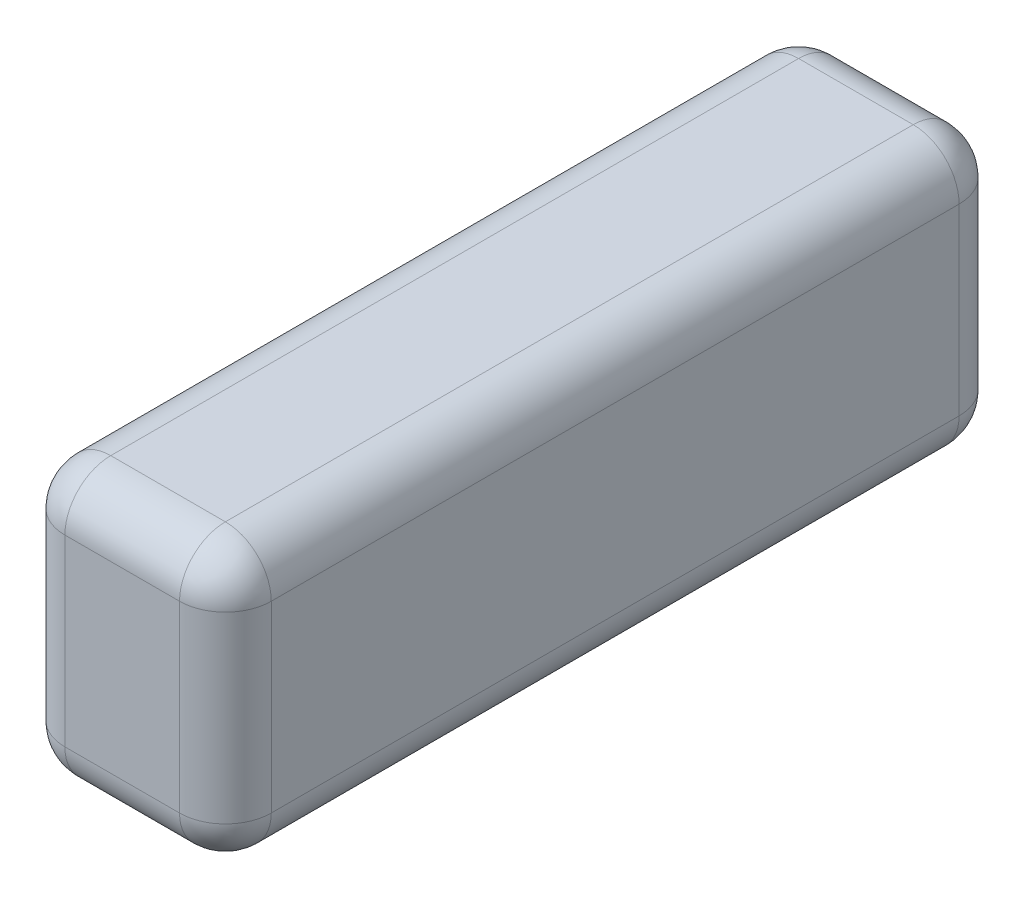
ISO-10303-21;
HEADER;
FILE_DESCRIPTION(('STEP AP214'),'2;1');
FILE_NAME('part.step','',(''),(''),'','','');
FILE_SCHEMA(('AUTOMOTIVE_DESIGN { 1 0 10303 214 1 1 1 1 }'));
ENDSEC;
DATA;
#1=APPLICATION_CONTEXT('core data for automotive mechanical design processes');
#2=APPLICATION_PROTOCOL_DEFINITION('international standard','automotive_design',2000,#1);
#3=PRODUCT_CONTEXT('',#1,'mechanical');
#4=PRODUCT('Part','Part','',(#3));
#5=PRODUCT_RELATED_PRODUCT_CATEGORY('part','',(#4));
#6=PRODUCT_DEFINITION_FORMATION('','',#4);
#7=PRODUCT_DEFINITION_CONTEXT('part definition',#1,'design');
#8=PRODUCT_DEFINITION('design','',#6,#7);
#9=PRODUCT_DEFINITION_SHAPE('','',#8);
#10=(LENGTH_UNIT() NAMED_UNIT(*) SI_UNIT(.MILLI.,.METRE.));
#11=(NAMED_UNIT(*) PLANE_ANGLE_UNIT() SI_UNIT($,.RADIAN.));
#12=(NAMED_UNIT(*) SI_UNIT($,.STERADIAN.) SOLID_ANGLE_UNIT());
#13=UNCERTAINTY_MEASURE_WITH_UNIT(LENGTH_MEASURE(1.E-05),#10,'distance_accuracy_value','');
#14=(GEOMETRIC_REPRESENTATION_CONTEXT(3) GLOBAL_UNCERTAINTY_ASSIGNED_CONTEXT((#13)) GLOBAL_UNIT_ASSIGNED_CONTEXT((#10,
#11,#12)) REPRESENTATION_CONTEXT('',''));
#15=CARTESIAN_POINT('',(0.,0.,0.));
#16=DIRECTION('',(0.,0.,1.));
#17=DIRECTION('',(1.,0.,0.));
#18=AXIS2_PLACEMENT_3D('',#15,#16,#17);
#19=CARTESIAN_POINT('',(0.,0.,170.));
#20=DIRECTION('',(1.,0.,0.));
#21=DIRECTION('',(0.,0.,-1.));
#22=AXIS2_PLACEMENT_3D('',#19,#20,#21);
#23=PLANE('',#22);
#24=DIRECTION('',(0.,-1.,0.));
#25=VECTOR('',#24,1.);
#26=CARTESIAN_POINT('',(0.,0.,160.));
#27=LINE('',#26,#25);
#28=CARTESIAN_POINT('',(0.,10.,160.));
#29=VERTEX_POINT('',#28);
#30=CARTESIAN_POINT('',(0.,50.,160.));
#31=VERTEX_POINT('',#30);
#32=EDGE_CURVE('E173',#29,#31,#27,.F.);
#33=ORIENTED_EDGE('',*,*,#32,.T.);
#34=DIRECTION('',(0.,0.,-1.));
#35=VECTOR('',#34,1.);
#36=CARTESIAN_POINT('',(0.,50.,170.));
#37=LINE('',#36,#35);
#38=CARTESIAN_POINT('',(0.,50.,10.));
#39=VERTEX_POINT('',#38);
#40=EDGE_CURVE('E140',#31,#39,#37,.T.);
#41=ORIENTED_EDGE('',*,*,#40,.T.);
#42=DIRECTION('',(0.,-1.,0.));
#43=VECTOR('',#42,1.);
#44=CARTESIAN_POINT('',(0.,0.,10.));
#45=LINE('',#44,#43);
#46=CARTESIAN_POINT('',(0.,10.,10.));
#47=VERTEX_POINT('',#46);
#48=EDGE_CURVE('E177',#39,#47,#45,.T.);
#49=ORIENTED_EDGE('',*,*,#48,.T.);
#50=DIRECTION('',(0.,0.,-1.));
#51=VECTOR('',#50,1.);
#52=CARTESIAN_POINT('',(0.,10.,170.));
#53=LINE('',#52,#51);
#54=EDGE_CURVE('E175',#47,#29,#53,.F.);
#55=ORIENTED_EDGE('',*,*,#54,.T.);
#56=EDGE_LOOP('',(#33,#41,#49,#55));
#57=FACE_BOUND('',#56,.T.);
#58=ADVANCED_FACE('F32',(#57),#23,.F.);
#59=CARTESIAN_POINT('',(0.,0.,170.));
#60=DIRECTION('',(0.,1.,0.));
#61=DIRECTION('',(0.,0.,1.));
#62=AXIS2_PLACEMENT_3D('',#59,#60,#61);
#63=PLANE('',#62);
#64=DIRECTION('',(0.,0.,-1.));
#65=VECTOR('',#64,1.);
#66=CARTESIAN_POINT('',(10.,0.,170.));
#67=LINE('',#66,#65);
#68=CARTESIAN_POINT('',(10.,0.,160.));
#69=VERTEX_POINT('',#68);
#70=CARTESIAN_POINT('',(10.,0.,10.));
#71=VERTEX_POINT('',#70);
#72=EDGE_CURVE('E193',#69,#71,#67,.T.);
#73=ORIENTED_EDGE('',*,*,#72,.T.);
#74=DIRECTION('',(1.,0.,0.));
#75=VECTOR('',#74,1.);
#76=CARTESIAN_POINT('',(45.,0.,10.));
#77=LINE('',#76,#75);
#78=CARTESIAN_POINT('',(35.,0.,10.));
#79=VERTEX_POINT('',#78);
#80=EDGE_CURVE('E196',#71,#79,#77,.T.);
#81=ORIENTED_EDGE('',*,*,#80,.T.);
#82=DIRECTION('',(0.,0.,-1.));
#83=VECTOR('',#82,1.);
#84=CARTESIAN_POINT('',(35.,0.,170.));
#85=LINE('',#84,#83);
#86=CARTESIAN_POINT('',(35.,0.,160.));
#87=VERTEX_POINT('',#86);
#88=EDGE_CURVE('E191',#79,#87,#85,.F.);
#89=ORIENTED_EDGE('',*,*,#88,.T.);
#90=DIRECTION('',(1.,0.,0.));
#91=VECTOR('',#90,1.);
#92=CARTESIAN_POINT('',(0.,0.,160.));
#93=LINE('',#92,#91);
#94=EDGE_CURVE('E189',#87,#69,#93,.F.);
#95=ORIENTED_EDGE('',*,*,#94,.T.);
#96=EDGE_LOOP('',(#73,#81,#89,#95));
#97=FACE_BOUND('',#96,.T.);
#98=ADVANCED_FACE('F274',(#97),#63,.F.);
#99=CARTESIAN_POINT('',(45.,0.,170.));
#100=DIRECTION('',(-1.,0.,0.));
#101=DIRECTION('',(0.,0.,1.));
#102=AXIS2_PLACEMENT_3D('',#99,#100,#101);
#103=PLANE('',#102);
#104=DIRECTION('',(0.,1.,0.));
#105=VECTOR('',#104,1.);
#106=CARTESIAN_POINT('',(45.,60.,10.));
#107=LINE('',#106,#105);
#108=CARTESIAN_POINT('',(45.,10.,10.));
#109=VERTEX_POINT('',#108);
#110=CARTESIAN_POINT('',(45.,50.,10.));
#111=VERTEX_POINT('',#110);
#112=EDGE_CURVE('E168',#109,#111,#107,.T.);
#113=ORIENTED_EDGE('',*,*,#112,.T.);
#114=DIRECTION('',(0.,0.,-1.));
#115=VECTOR('',#114,1.);
#116=CARTESIAN_POINT('',(45.,50.,170.));
#117=LINE('',#116,#115);
#118=CARTESIAN_POINT('',(45.,50.,160.));
#119=VERTEX_POINT('',#118);
#120=EDGE_CURVE('E170',#111,#119,#117,.F.);
#121=ORIENTED_EDGE('',*,*,#120,.T.);
#122=DIRECTION('',(0.,1.,0.));
#123=VECTOR('',#122,1.);
#124=CARTESIAN_POINT('',(45.,0.,160.));
#125=LINE('',#124,#123);
#126=CARTESIAN_POINT('',(45.,10.,160.));
#127=VERTEX_POINT('',#126);
#128=EDGE_CURVE('E164',#119,#127,#125,.F.);
#129=ORIENTED_EDGE('',*,*,#128,.T.);
#130=DIRECTION('',(0.,0.,-1.));
#131=VECTOR('',#130,1.);
#132=CARTESIAN_POINT('',(45.,10.,170.));
#133=LINE('',#132,#131);
#134=EDGE_CURVE('E166',#127,#109,#133,.T.);
#135=ORIENTED_EDGE('',*,*,#134,.T.);
#136=EDGE_LOOP('',(#113,#121,#129,#135));
#137=FACE_BOUND('',#136,.T.);
#138=ADVANCED_FACE('F301',(#137),#103,.F.);
#139=CARTESIAN_POINT('',(0.,60.,170.));
#140=DIRECTION('',(0.,-1.,0.));
#141=DIRECTION('',(0.,0.,-1.));
#142=AXIS2_PLACEMENT_3D('',#139,#140,#141);
#143=PLANE('',#142);
#144=DIRECTION('',(0.,0.,-1.));
#145=VECTOR('',#144,1.);
#146=CARTESIAN_POINT('',(35.,60.,170.));
#147=LINE('',#146,#145);
#148=CARTESIAN_POINT('',(35.,60.,160.));
#149=VERTEX_POINT('',#148);
#150=CARTESIAN_POINT('',(35.,60.,10.));
#151=VERTEX_POINT('',#150);
#152=EDGE_CURVE('E132',#149,#151,#147,.T.);
#153=ORIENTED_EDGE('',*,*,#152,.T.);
#154=DIRECTION('',(-1.,0.,0.));
#155=VECTOR('',#154,1.);
#156=CARTESIAN_POINT('',(0.,60.,10.));
#157=LINE('',#156,#155);
#158=CARTESIAN_POINT('',(10.,60.,10.));
#159=VERTEX_POINT('',#158);
#160=EDGE_CURVE('E128',#151,#159,#157,.T.);
#161=ORIENTED_EDGE('',*,*,#160,.T.);
#162=DIRECTION('',(0.,0.,-1.));
#163=VECTOR('',#162,1.);
#164=CARTESIAN_POINT('',(10.,60.,170.));
#165=LINE('',#164,#163);
#166=CARTESIAN_POINT('',(10.,60.,160.));
#167=VERTEX_POINT('',#166);
#168=EDGE_CURVE('E120',#159,#167,#165,.F.);
#169=ORIENTED_EDGE('',*,*,#168,.T.);
#170=DIRECTION('',(-1.,0.,0.));
#171=VECTOR('',#170,1.);
#172=CARTESIAN_POINT('',(0.,60.,160.));
#173=LINE('',#172,#171);
#174=EDGE_CURVE('E125',#167,#149,#173,.F.);
#175=ORIENTED_EDGE('',*,*,#174,.T.);
#176=EDGE_LOOP('',(#153,#161,#169,#175));
#177=FACE_BOUND('',#176,.T.);
#178=ADVANCED_FACE('F123',(#177),#143,.F.);
#179=CARTESIAN_POINT('',(0.,0.,170.));
#180=DIRECTION('',(0.,0.,-1.));
#181=DIRECTION('',(-1.,0.,0.));
#182=AXIS2_PLACEMENT_3D('',#179,#180,#181);
#183=PLANE('',#182);
#184=DIRECTION('',(0.,1.,0.));
#185=VECTOR('',#184,1.);
#186=CARTESIAN_POINT('',(35.,0.,170.));
#187=LINE('',#186,#185);
#188=CARTESIAN_POINT('',(35.,10.,170.));
#189=VERTEX_POINT('',#188);
#190=CARTESIAN_POINT('',(35.,50.,170.));
#191=VERTEX_POINT('',#190);
#192=EDGE_CURVE('E41',#189,#191,#187,.T.);
#193=ORIENTED_EDGE('',*,*,#192,.T.);
#194=DIRECTION('',(-1.,0.,0.));
#195=VECTOR('',#194,1.);
#196=CARTESIAN_POINT('',(0.,50.,170.));
#197=LINE('',#196,#195);
#198=CARTESIAN_POINT('',(10.,50.,170.));
#199=VERTEX_POINT('',#198);
#200=EDGE_CURVE('E11',#191,#199,#197,.T.);
#201=ORIENTED_EDGE('',*,*,#200,.T.);
#202=DIRECTION('',(0.,-1.,0.));
#203=VECTOR('',#202,1.);
#204=CARTESIAN_POINT('',(10.,0.,170.));
#205=LINE('',#204,#203);
#206=CARTESIAN_POINT('',(10.,10.,170.));
#207=VERTEX_POINT('',#206);
#208=EDGE_CURVE('E198',#199,#207,#205,.T.);
#209=ORIENTED_EDGE('',*,*,#208,.T.);
#210=DIRECTION('',(1.,0.,0.));
#211=VECTOR('',#210,1.);
#212=CARTESIAN_POINT('',(0.,10.,170.));
#213=LINE('',#212,#211);
#214=EDGE_CURVE('E52',#207,#189,#213,.T.);
#215=ORIENTED_EDGE('',*,*,#214,.T.);
#216=EDGE_LOOP('',(#193,#201,#209,#215));
#217=FACE_BOUND('',#216,.T.);
#218=ADVANCED_FACE('F363',(#217),#183,.F.);
#219=CARTESIAN_POINT('',(0.,0.,0.));
#220=DIRECTION('',(0.,0.,-1.));
#221=DIRECTION('',(-1.,0.,0.));
#222=AXIS2_PLACEMENT_3D('',#219,#220,#221);
#223=PLANE('',#222);
#224=DIRECTION('',(-1.,0.,0.));
#225=VECTOR('',#224,1.);
#226=CARTESIAN_POINT('',(45.,50.,0.));
#227=LINE('',#226,#225);
#228=CARTESIAN_POINT('',(10.,50.,0.));
#229=VERTEX_POINT('',#228);
#230=CARTESIAN_POINT('',(35.,50.,0.));
#231=VERTEX_POINT('',#230);
#232=EDGE_CURVE('E184',#229,#231,#227,.F.);
#233=ORIENTED_EDGE('',*,*,#232,.T.);
#234=DIRECTION('',(0.,1.,0.));
#235=VECTOR('',#234,1.);
#236=CARTESIAN_POINT('',(35.,0.,0.));
#237=LINE('',#236,#235);
#238=CARTESIAN_POINT('',(35.,10.,0.));
#239=VERTEX_POINT('',#238);
#240=EDGE_CURVE('E186',#231,#239,#237,.F.);
#241=ORIENTED_EDGE('',*,*,#240,.T.);
#242=DIRECTION('',(1.,0.,0.));
#243=VECTOR('',#242,1.);
#244=CARTESIAN_POINT('',(0.,10.,0.));
#245=LINE('',#244,#243);
#246=CARTESIAN_POINT('',(10.,10.,0.));
#247=VERTEX_POINT('',#246);
#248=EDGE_CURVE('E180',#239,#247,#245,.F.);
#249=ORIENTED_EDGE('',*,*,#248,.T.);
#250=DIRECTION('',(0.,-1.,0.));
#251=VECTOR('',#250,1.);
#252=CARTESIAN_POINT('',(10.,60.,0.));
#253=LINE('',#252,#251);
#254=EDGE_CURVE('E182',#247,#229,#253,.F.);
#255=ORIENTED_EDGE('',*,*,#254,.T.);
#256=EDGE_LOOP('',(#233,#241,#249,#255));
#257=FACE_BOUND('',#256,.T.);
#258=ADVANCED_FACE('F265',(#257),#223,.T.);
#259=CARTESIAN_POINT('',(10.,10.,170.));
#260=DIRECTION('',(0.,0.,-1.));
#261=DIRECTION('',(-1.,0.,0.));
#262=AXIS2_PLACEMENT_3D('',#259,#260,#261);
#263=CYLINDRICAL_SURFACE('',#262,10.);
#264=CARTESIAN_POINT('',(10.,10.,160.));
#265=DIRECTION('',(0.,0.,1.));
#266=DIRECTION('',(1.,0.,0.));
#267=AXIS2_PLACEMENT_3D('',#264,#265,#266);
#268=CIRCLE('',#267,10.);
#269=EDGE_CURVE('E36',#29,#69,#268,.T.);
#270=ORIENTED_EDGE('',*,*,#269,.F.);
#271=ORIENTED_EDGE('',*,*,#54,.F.);
#272=CARTESIAN_POINT('',(10.,10.,10.));
#273=DIRECTION('',(0.,0.,-1.));
#274=DIRECTION('',(-1.,0.,0.));
#275=AXIS2_PLACEMENT_3D('',#272,#273,#274);
#276=CIRCLE('',#275,10.);
#277=EDGE_CURVE('E160',#71,#47,#276,.T.);
#278=ORIENTED_EDGE('',*,*,#277,.F.);
#279=ORIENTED_EDGE('',*,*,#72,.F.);
#280=EDGE_LOOP('',(#270,#271,#278,#279));
#281=FACE_BOUND('',#280,.T.);
#282=ADVANCED_FACE('F34',(#281),#263,.T.);
#283=CARTESIAN_POINT('',(10.,10.,160.));
#284=DIRECTION('',(0.,0.,1.));
#285=DIRECTION('',(1.,0.,0.));
#286=AXIS2_PLACEMENT_3D('',#283,#284,#285);
#287=SPHERICAL_SURFACE('',#286,10.);
#288=CARTESIAN_POINT('',(10.,10.,160.));
#289=DIRECTION('',(0.,-1.,0.));
#290=DIRECTION('',(0.,0.,-1.));
#291=AXIS2_PLACEMENT_3D('',#288,#289,#290);
#292=CIRCLE('',#291,10.);
#293=EDGE_CURVE('E244',#29,#207,#292,.F.);
#294=ORIENTED_EDGE('',*,*,#293,.F.);
#295=ORIENTED_EDGE('',*,*,#269,.T.);
#296=CARTESIAN_POINT('',(10.,10.,160.));
#297=DIRECTION('',(-1.,0.,0.));
#298=DIRECTION('',(0.,0.,1.));
#299=AXIS2_PLACEMENT_3D('',#296,#297,#298);
#300=CIRCLE('',#299,10.);
#301=EDGE_CURVE('E247',#207,#69,#300,.F.);
#302=ORIENTED_EDGE('',*,*,#301,.F.);
#303=EDGE_LOOP('',(#294,#295,#302));
#304=FACE_BOUND('',#303,.T.);
#305=ADVANCED_FACE('F291',(#304),#287,.T.);
#306=CARTESIAN_POINT('',(10.,10.,10.));
#307=DIRECTION('',(0.,0.,1.));
#308=DIRECTION('',(1.,0.,0.));
#309=AXIS2_PLACEMENT_3D('',#306,#307,#308);
#310=SPHERICAL_SURFACE('',#309,10.);
#311=CARTESIAN_POINT('',(10.,10.,10.));
#312=DIRECTION('',(-1.,0.,0.));
#313=DIRECTION('',(0.,0.,1.));
#314=AXIS2_PLACEMENT_3D('',#311,#312,#313);
#315=CIRCLE('',#314,10.);
#316=EDGE_CURVE('E238',#71,#247,#315,.F.);
#317=ORIENTED_EDGE('',*,*,#316,.F.);
#318=ORIENTED_EDGE('',*,*,#277,.T.);
#319=CARTESIAN_POINT('',(10.,10.,10.));
#320=DIRECTION('',(0.,-1.,0.));
#321=DIRECTION('',(0.,0.,-1.));
#322=AXIS2_PLACEMENT_3D('',#319,#320,#321);
#323=CIRCLE('',#322,10.);
#324=EDGE_CURVE('E241',#247,#47,#323,.F.);
#325=ORIENTED_EDGE('',*,*,#324,.F.);
#326=EDGE_LOOP('',(#317,#318,#325));
#327=FACE_BOUND('',#326,.T.);
#328=ADVANCED_FACE('F254',(#327),#310,.T.);
#329=CARTESIAN_POINT('',(0.,10.,160.));
#330=DIRECTION('',(1.,0.,0.));
#331=DIRECTION('',(0.,0.,-1.));
#332=AXIS2_PLACEMENT_3D('',#329,#330,#331);
#333=CYLINDRICAL_SURFACE('',#332,10.);
#334=ORIENTED_EDGE('',*,*,#301,.T.);
#335=ORIENTED_EDGE('',*,*,#94,.F.);
#336=CARTESIAN_POINT('',(35.,10.,160.));
#337=DIRECTION('',(1.,0.,0.));
#338=DIRECTION('',(0.,0.,-1.));
#339=AXIS2_PLACEMENT_3D('',#336,#337,#338);
#340=CIRCLE('',#339,10.);
#341=EDGE_CURVE('E232',#189,#87,#340,.T.);
#342=ORIENTED_EDGE('',*,*,#341,.F.);
#343=ORIENTED_EDGE('',*,*,#214,.F.);
#344=EDGE_LOOP('',(#334,#335,#342,#343));
#345=FACE_BOUND('',#344,.T.);
#346=ADVANCED_FACE('F286',(#345),#333,.T.);
#347=CARTESIAN_POINT('',(10.,0.,160.));
#348=DIRECTION('',(0.,-1.,0.));
#349=DIRECTION('',(0.,0.,-1.));
#350=AXIS2_PLACEMENT_3D('',#347,#348,#349);
#351=CYLINDRICAL_SURFACE('',#350,10.);
#352=ORIENTED_EDGE('',*,*,#293,.T.);
#353=ORIENTED_EDGE('',*,*,#208,.F.);
#354=CARTESIAN_POINT('',(10.,50.,160.));
#355=DIRECTION('',(0.,1.,0.));
#356=DIRECTION('',(0.,0.,1.));
#357=AXIS2_PLACEMENT_3D('',#354,#355,#356);
#358=CIRCLE('',#357,10.);
#359=EDGE_CURVE('E144',#31,#199,#358,.T.);
#360=ORIENTED_EDGE('',*,*,#359,.F.);
#361=ORIENTED_EDGE('',*,*,#32,.F.);
#362=EDGE_LOOP('',(#352,#353,#360,#361));
#363=FACE_BOUND('',#362,.T.);
#364=ADVANCED_FACE('F294',(#363),#351,.T.);
#365=CARTESIAN_POINT('',(10.,50.,170.));
#366=DIRECTION('',(0.,0.,-1.));
#367=DIRECTION('',(-1.,0.,0.));
#368=AXIS2_PLACEMENT_3D('',#365,#366,#367);
#369=CYLINDRICAL_SURFACE('',#368,10.);
#370=CARTESIAN_POINT('',(10.,50.,10.));
#371=DIRECTION('',(0.,0.,-1.));
#372=DIRECTION('',(-1.,0.,0.));
#373=AXIS2_PLACEMENT_3D('',#370,#371,#372);
#374=CIRCLE('',#373,10.);
#375=EDGE_CURVE('E145',#39,#159,#374,.T.);
#376=ORIENTED_EDGE('',*,*,#375,.F.);
#377=ORIENTED_EDGE('',*,*,#40,.F.);
#378=CARTESIAN_POINT('',(10.,50.,160.));
#379=DIRECTION('',(0.,0.,1.));
#380=DIRECTION('',(1.,0.,0.));
#381=AXIS2_PLACEMENT_3D('',#378,#379,#380);
#382=CIRCLE('',#381,10.);
#383=EDGE_CURVE('E136',#167,#31,#382,.T.);
#384=ORIENTED_EDGE('',*,*,#383,.F.);
#385=ORIENTED_EDGE('',*,*,#168,.F.);
#386=EDGE_LOOP('',(#376,#377,#384,#385));
#387=FACE_BOUND('',#386,.T.);
#388=ADVANCED_FACE('F138',(#387),#369,.T.);
#389=CARTESIAN_POINT('',(10.,0.,10.));
#390=DIRECTION('',(0.,1.,0.));
#391=DIRECTION('',(0.,0.,1.));
#392=AXIS2_PLACEMENT_3D('',#389,#390,#391);
#393=CYLINDRICAL_SURFACE('',#392,10.);
#394=ORIENTED_EDGE('',*,*,#324,.T.);
#395=ORIENTED_EDGE('',*,*,#48,.F.);
#396=CARTESIAN_POINT('',(10.,50.,10.));
#397=DIRECTION('',(0.,1.,0.));
#398=DIRECTION('',(0.,0.,1.));
#399=AXIS2_PLACEMENT_3D('',#396,#397,#398);
#400=CIRCLE('',#399,10.);
#401=EDGE_CURVE('E228',#229,#39,#400,.T.);
#402=ORIENTED_EDGE('',*,*,#401,.F.);
#403=ORIENTED_EDGE('',*,*,#254,.F.);
#404=EDGE_LOOP('',(#394,#395,#402,#403));
#405=FACE_BOUND('',#404,.T.);
#406=ADVANCED_FACE('F261',(#405),#393,.T.);
#407=CARTESIAN_POINT('',(0.,10.,10.));
#408=DIRECTION('',(-1.,0.,0.));
#409=DIRECTION('',(0.,0.,1.));
#410=AXIS2_PLACEMENT_3D('',#407,#408,#409);
#411=CYLINDRICAL_SURFACE('',#410,10.);
#412=ORIENTED_EDGE('',*,*,#316,.T.);
#413=ORIENTED_EDGE('',*,*,#248,.F.);
#414=CARTESIAN_POINT('',(35.,10.,10.));
#415=DIRECTION('',(1.,0.,0.));
#416=DIRECTION('',(0.,0.,-1.));
#417=AXIS2_PLACEMENT_3D('',#414,#415,#416);
#418=CIRCLE('',#417,10.);
#419=EDGE_CURVE('E225',#79,#239,#418,.T.);
#420=ORIENTED_EDGE('',*,*,#419,.F.);
#421=ORIENTED_EDGE('',*,*,#80,.F.);
#422=EDGE_LOOP('',(#412,#413,#420,#421));
#423=FACE_BOUND('',#422,.T.);
#424=ADVANCED_FACE('F271',(#423),#411,.T.);
#425=CARTESIAN_POINT('',(35.,10.,170.));
#426=DIRECTION('',(0.,0.,-1.));
#427=DIRECTION('',(-1.,0.,0.));
#428=AXIS2_PLACEMENT_3D('',#425,#426,#427);
#429=CYLINDRICAL_SURFACE('',#428,10.);
#430=CARTESIAN_POINT('',(35.,10.,160.));
#431=DIRECTION('',(0.,0.,1.));
#432=DIRECTION('',(1.,0.,0.));
#433=AXIS2_PLACEMENT_3D('',#430,#431,#432);
#434=CIRCLE('',#433,10.);
#435=EDGE_CURVE('E235',#87,#127,#434,.T.);
#436=ORIENTED_EDGE('',*,*,#435,.F.);
#437=ORIENTED_EDGE('',*,*,#88,.F.);
#438=CARTESIAN_POINT('',(35.,10.,10.));
#439=DIRECTION('',(0.,0.,-1.));
#440=DIRECTION('',(-1.,0.,0.));
#441=AXIS2_PLACEMENT_3D('',#438,#439,#440);
#442=CIRCLE('',#441,10.);
#443=EDGE_CURVE('E222',#109,#79,#442,.T.);
#444=ORIENTED_EDGE('',*,*,#443,.F.);
#445=ORIENTED_EDGE('',*,*,#134,.F.);
#446=EDGE_LOOP('',(#436,#437,#444,#445));
#447=FACE_BOUND('',#446,.T.);
#448=ADVANCED_FACE('F279',(#447),#429,.T.);
#449=CARTESIAN_POINT('',(35.,10.,160.));
#450=DIRECTION('',(0.,0.,1.));
#451=DIRECTION('',(1.,0.,0.));
#452=AXIS2_PLACEMENT_3D('',#449,#450,#451);
#453=SPHERICAL_SURFACE('',#452,10.);
#454=ORIENTED_EDGE('',*,*,#341,.T.);
#455=ORIENTED_EDGE('',*,*,#435,.T.);
#456=CARTESIAN_POINT('',(35.,10.,160.));
#457=DIRECTION('',(0.,-1.,0.));
#458=DIRECTION('',(0.,0.,-1.));
#459=AXIS2_PLACEMENT_3D('',#456,#457,#458);
#460=CIRCLE('',#459,10.);
#461=EDGE_CURVE('E151',#189,#127,#460,.F.);
#462=ORIENTED_EDGE('',*,*,#461,.F.);
#463=EDGE_LOOP('',(#454,#455,#462));
#464=FACE_BOUND('',#463,.T.);
#465=ADVANCED_FACE('F284',(#464),#453,.T.);
#466=CARTESIAN_POINT('',(10.,50.,160.));
#467=DIRECTION('',(0.,0.,1.));
#468=DIRECTION('',(1.,0.,0.));
#469=AXIS2_PLACEMENT_3D('',#466,#467,#468);
#470=SPHERICAL_SURFACE('',#469,10.);
#471=ORIENTED_EDGE('',*,*,#383,.T.);
#472=ORIENTED_EDGE('',*,*,#359,.T.);
#473=CARTESIAN_POINT('',(10.,50.,160.));
#474=DIRECTION('',(-1.,0.,0.));
#475=DIRECTION('',(0.,0.,1.));
#476=AXIS2_PLACEMENT_3D('',#473,#474,#475);
#477=CIRCLE('',#476,10.);
#478=EDGE_CURVE('E147',#167,#199,#477,.F.);
#479=ORIENTED_EDGE('',*,*,#478,.F.);
#480=EDGE_LOOP('',(#471,#472,#479));
#481=FACE_BOUND('',#480,.T.);
#482=ADVANCED_FACE('F148',(#481),#470,.T.);
#483=CARTESIAN_POINT('',(10.,50.,10.));
#484=DIRECTION('',(0.,0.,1.));
#485=DIRECTION('',(1.,0.,0.));
#486=AXIS2_PLACEMENT_3D('',#483,#484,#485);
#487=SPHERICAL_SURFACE('',#486,10.);
#488=ORIENTED_EDGE('',*,*,#401,.T.);
#489=ORIENTED_EDGE('',*,*,#375,.T.);
#490=CARTESIAN_POINT('',(10.,50.,10.));
#491=DIRECTION('',(-1.,0.,0.));
#492=DIRECTION('',(0.,0.,1.));
#493=AXIS2_PLACEMENT_3D('',#490,#491,#492);
#494=CIRCLE('',#493,10.);
#495=EDGE_CURVE('E152',#229,#159,#494,.F.);
#496=ORIENTED_EDGE('',*,*,#495,.F.);
#497=EDGE_LOOP('',(#488,#489,#496));
#498=FACE_BOUND('',#497,.T.);
#499=ADVANCED_FACE('F334',(#498),#487,.T.);
#500=CARTESIAN_POINT('',(35.,10.,10.));
#501=DIRECTION('',(0.,0.,1.));
#502=DIRECTION('',(1.,0.,0.));
#503=AXIS2_PLACEMENT_3D('',#500,#501,#502);
#504=SPHERICAL_SURFACE('',#503,10.);
#505=ORIENTED_EDGE('',*,*,#443,.T.);
#506=ORIENTED_EDGE('',*,*,#419,.T.);
#507=CARTESIAN_POINT('',(35.,10.,10.));
#508=DIRECTION('',(0.,-1.,0.));
#509=DIRECTION('',(0.,0.,-1.));
#510=AXIS2_PLACEMENT_3D('',#507,#508,#509);
#511=CIRCLE('',#510,10.);
#512=EDGE_CURVE('E216',#109,#239,#511,.F.);
#513=ORIENTED_EDGE('',*,*,#512,.F.);
#514=EDGE_LOOP('',(#505,#506,#513));
#515=FACE_BOUND('',#514,.T.);
#516=ADVANCED_FACE('F330',(#515),#504,.T.);
#517=CARTESIAN_POINT('',(35.,0.,160.));
#518=DIRECTION('',(0.,1.,0.));
#519=DIRECTION('',(0.,0.,1.));
#520=AXIS2_PLACEMENT_3D('',#517,#518,#519);
#521=CYLINDRICAL_SURFACE('',#520,10.);
#522=ORIENTED_EDGE('',*,*,#461,.T.);
#523=ORIENTED_EDGE('',*,*,#128,.F.);
#524=CARTESIAN_POINT('',(35.,50.,160.));
#525=DIRECTION('',(0.,1.,0.));
#526=DIRECTION('',(0.,0.,1.));
#527=AXIS2_PLACEMENT_3D('',#524,#525,#526);
#528=CIRCLE('',#527,10.);
#529=EDGE_CURVE('E213',#191,#119,#528,.T.);
#530=ORIENTED_EDGE('',*,*,#529,.F.);
#531=ORIENTED_EDGE('',*,*,#192,.F.);
#532=EDGE_LOOP('',(#522,#523,#530,#531));
#533=FACE_BOUND('',#532,.T.);
#534=ADVANCED_FACE('F327',(#533),#521,.T.);
#535=CARTESIAN_POINT('',(0.,50.,160.));
#536=DIRECTION('',(-1.,0.,0.));
#537=DIRECTION('',(0.,0.,1.));
#538=AXIS2_PLACEMENT_3D('',#535,#536,#537);
#539=CYLINDRICAL_SURFACE('',#538,10.);
#540=ORIENTED_EDGE('',*,*,#478,.T.);
#541=ORIENTED_EDGE('',*,*,#200,.F.);
#542=CARTESIAN_POINT('',(35.,50.,160.));
#543=DIRECTION('',(1.,0.,0.));
#544=DIRECTION('',(0.,0.,-1.));
#545=AXIS2_PLACEMENT_3D('',#542,#543,#544);
#546=CIRCLE('',#545,10.);
#547=EDGE_CURVE('E156',#149,#191,#546,.T.);
#548=ORIENTED_EDGE('',*,*,#547,.F.);
#549=ORIENTED_EDGE('',*,*,#174,.F.);
#550=EDGE_LOOP('',(#540,#541,#548,#549));
#551=FACE_BOUND('',#550,.T.);
#552=ADVANCED_FACE('F154',(#551),#539,.T.);
#553=CARTESIAN_POINT('',(0.,50.,10.));
#554=DIRECTION('',(1.,0.,0.));
#555=DIRECTION('',(0.,0.,-1.));
#556=AXIS2_PLACEMENT_3D('',#553,#554,#555);
#557=CYLINDRICAL_SURFACE('',#556,10.);
#558=ORIENTED_EDGE('',*,*,#495,.T.);
#559=ORIENTED_EDGE('',*,*,#160,.F.);
#560=CARTESIAN_POINT('',(35.,50.,10.));
#561=DIRECTION('',(1.,0.,0.));
#562=DIRECTION('',(0.,0.,-1.));
#563=AXIS2_PLACEMENT_3D('',#560,#561,#562);
#564=CIRCLE('',#563,10.);
#565=EDGE_CURVE('E209',#231,#151,#564,.T.);
#566=ORIENTED_EDGE('',*,*,#565,.F.);
#567=ORIENTED_EDGE('',*,*,#232,.F.);
#568=EDGE_LOOP('',(#558,#559,#566,#567));
#569=FACE_BOUND('',#568,.T.);
#570=ADVANCED_FACE('F320',(#569),#557,.T.);
#571=CARTESIAN_POINT('',(35.,0.,10.));
#572=DIRECTION('',(0.,-1.,0.));
#573=DIRECTION('',(0.,0.,-1.));
#574=AXIS2_PLACEMENT_3D('',#571,#572,#573);
#575=CYLINDRICAL_SURFACE('',#574,10.);
#576=ORIENTED_EDGE('',*,*,#512,.T.);
#577=ORIENTED_EDGE('',*,*,#240,.F.);
#578=CARTESIAN_POINT('',(35.,50.,10.));
#579=DIRECTION('',(0.,1.,0.));
#580=DIRECTION('',(0.,0.,1.));
#581=AXIS2_PLACEMENT_3D('',#578,#579,#580);
#582=CIRCLE('',#581,10.);
#583=EDGE_CURVE('E206',#111,#231,#582,.T.);
#584=ORIENTED_EDGE('',*,*,#583,.F.);
#585=ORIENTED_EDGE('',*,*,#112,.F.);
#586=EDGE_LOOP('',(#576,#577,#584,#585));
#587=FACE_BOUND('',#586,.T.);
#588=ADVANCED_FACE('F316',(#587),#575,.T.);
#589=CARTESIAN_POINT('',(35.,50.,160.));
#590=DIRECTION('',(0.,0.,1.));
#591=DIRECTION('',(1.,0.,0.));
#592=AXIS2_PLACEMENT_3D('',#589,#590,#591);
#593=SPHERICAL_SURFACE('',#592,10.);
#594=ORIENTED_EDGE('',*,*,#547,.T.);
#595=ORIENTED_EDGE('',*,*,#529,.T.);
#596=CARTESIAN_POINT('',(35.,50.,160.));
#597=DIRECTION('',(0.,0.,1.));
#598=DIRECTION('',(1.,0.,0.));
#599=AXIS2_PLACEMENT_3D('',#596,#597,#598);
#600=CIRCLE('',#599,10.);
#601=EDGE_CURVE('E204',#149,#119,#600,.F.);
#602=ORIENTED_EDGE('',*,*,#601,.F.);
#603=EDGE_LOOP('',(#594,#595,#602));
#604=FACE_BOUND('',#603,.T.);
#605=ADVANCED_FACE('F312',(#604),#593,.T.);
#606=CARTESIAN_POINT('',(35.,50.,10.));
#607=DIRECTION('',(0.,0.,1.));
#608=DIRECTION('',(1.,0.,0.));
#609=AXIS2_PLACEMENT_3D('',#606,#607,#608);
#610=SPHERICAL_SURFACE('',#609,10.);
#611=ORIENTED_EDGE('',*,*,#583,.T.);
#612=ORIENTED_EDGE('',*,*,#565,.T.);
#613=CARTESIAN_POINT('',(35.,50.,10.));
#614=DIRECTION('',(0.,0.,-1.));
#615=DIRECTION('',(-1.,0.,0.));
#616=AXIS2_PLACEMENT_3D('',#613,#614,#615);
#617=CIRCLE('',#616,10.);
#618=EDGE_CURVE('E202',#111,#151,#617,.F.);
#619=ORIENTED_EDGE('',*,*,#618,.F.);
#620=EDGE_LOOP('',(#611,#612,#619));
#621=FACE_BOUND('',#620,.T.);
#622=ADVANCED_FACE('F308',(#621),#610,.T.);
#623=CARTESIAN_POINT('',(35.,50.,170.));
#624=DIRECTION('',(0.,0.,-1.));
#625=DIRECTION('',(-1.,0.,0.));
#626=AXIS2_PLACEMENT_3D('',#623,#624,#625);
#627=CYLINDRICAL_SURFACE('',#626,10.);
#628=ORIENTED_EDGE('',*,*,#601,.T.);
#629=ORIENTED_EDGE('',*,*,#120,.F.);
#630=ORIENTED_EDGE('',*,*,#618,.T.);
#631=ORIENTED_EDGE('',*,*,#152,.F.);
#632=EDGE_LOOP('',(#628,#629,#630,#631));
#633=FACE_BOUND('',#632,.T.);
#634=ADVANCED_FACE('F305',(#633),#627,.T.);
#635=CLOSED_SHELL('',(#58,#98,#138,#178,#218,#258,#282,#305,#328,#346,#364,#388,#406,#424,#448,
#465,#482,#499,#516,#534,#552,#570,#588,#605,#622,#634));
#636=MANIFOLD_SOLID_BREP('B2',#635);
#637=ADVANCED_BREP_SHAPE_REPRESENTATION('',(#18,#636),#14);
#638=SHAPE_DEFINITION_REPRESENTATION(#9,#637);
ENDSEC;
END-ISO-10303-21;
